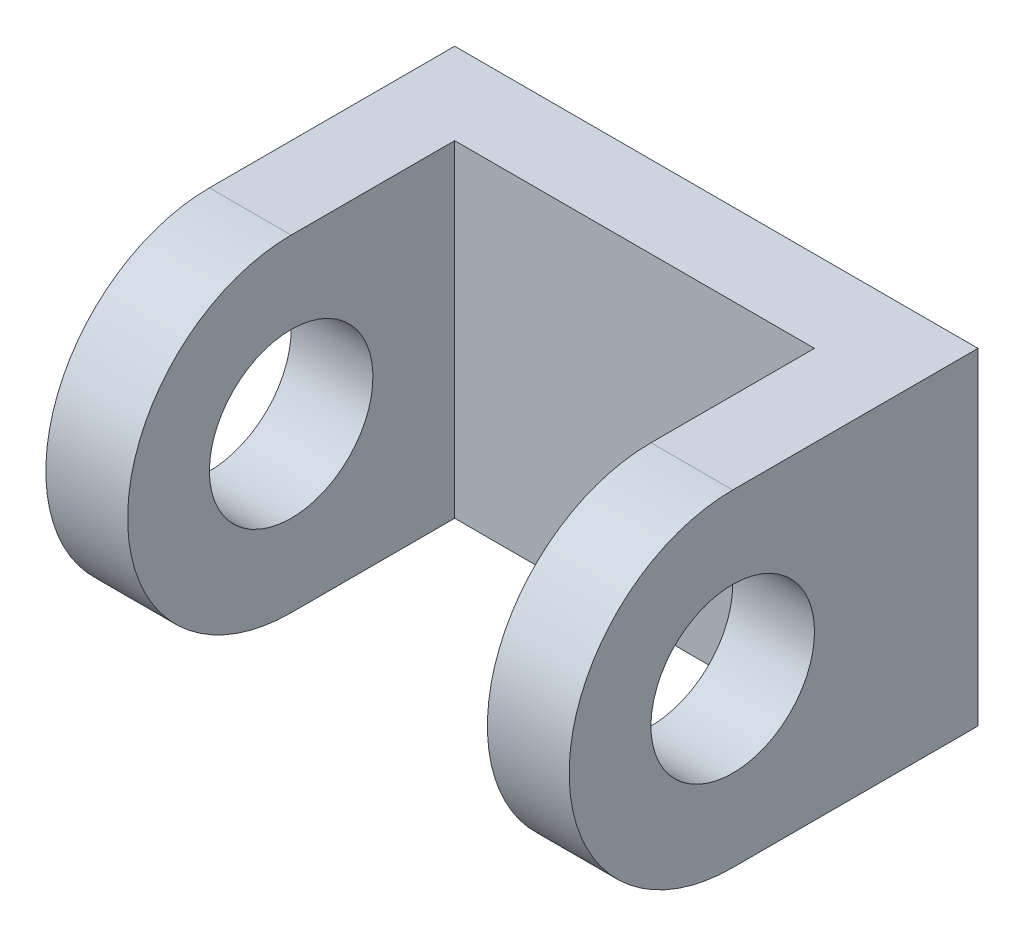
ISO-10303-21;
HEADER;
FILE_DESCRIPTION(('STEP AP214'),'2;1');
FILE_NAME('part.step','',(''),(''),'','','');
FILE_SCHEMA(('AUTOMOTIVE_DESIGN { 1 0 10303 214 1 1 1 1 }'));
ENDSEC;
DATA;
#1=APPLICATION_CONTEXT('core data for automotive mechanical design processes');
#2=APPLICATION_PROTOCOL_DEFINITION('international standard','automotive_design',2000,#1);
#3=PRODUCT_CONTEXT('',#1,'mechanical');
#4=PRODUCT('Part','Part','',(#3));
#5=PRODUCT_RELATED_PRODUCT_CATEGORY('part','',(#4));
#6=PRODUCT_DEFINITION_FORMATION('','',#4);
#7=PRODUCT_DEFINITION_CONTEXT('part definition',#1,'design');
#8=PRODUCT_DEFINITION('design','',#6,#7);
#9=PRODUCT_DEFINITION_SHAPE('','',#8);
#10=(LENGTH_UNIT() NAMED_UNIT(*) SI_UNIT(.MILLI.,.METRE.));
#11=(NAMED_UNIT(*) PLANE_ANGLE_UNIT() SI_UNIT($,.RADIAN.));
#12=(NAMED_UNIT(*) SI_UNIT($,.STERADIAN.) SOLID_ANGLE_UNIT());
#13=UNCERTAINTY_MEASURE_WITH_UNIT(LENGTH_MEASURE(1.E-05),#10,'distance_accuracy_value','');
#14=(GEOMETRIC_REPRESENTATION_CONTEXT(3) GLOBAL_UNCERTAINTY_ASSIGNED_CONTEXT((#13)) GLOBAL_UNIT_ASSIGNED_CONTEXT((#10,
#11,#12)) REPRESENTATION_CONTEXT('',''));
#15=CARTESIAN_POINT('',(0.,0.,0.));
#16=DIRECTION('',(0.,0.,1.));
#17=DIRECTION('',(1.,0.,0.));
#18=AXIS2_PLACEMENT_3D('',#15,#16,#17);
#19=CARTESIAN_POINT('',(20.32,12.7,31.75));
#20=DIRECTION('',(-1.,0.,0.));
#21=DIRECTION('',(0.,-1.,0.));
#22=AXIS2_PLACEMENT_3D('',#19,#20,#21);
#23=PLANE('',#22);
#24=CARTESIAN_POINT('',(20.32,0.,19.05));
#25=DIRECTION('',(1.,0.,0.));
#26=DIRECTION('',(0.,1.,0.));
#27=AXIS2_PLACEMENT_3D('',#24,#25,#26);
#28=CIRCLE('',#27,6.35);
#29=CARTESIAN_POINT('',(20.32,6.35,19.05));
#30=VERTEX_POINT('',#29);
#31=EDGE_CURVE('E137',#30,#30,#28,.T.);
#32=ORIENTED_EDGE('',*,*,#31,.F.);
#33=EDGE_LOOP('',(#32));
#34=FACE_BOUND('',#33,.T.);
#35=CARTESIAN_POINT('',(20.32,0.,19.05));
#36=DIRECTION('',(-1.,0.,0.));
#37=DIRECTION('',(0.,1.,0.));
#38=AXIS2_PLACEMENT_3D('',#35,#36,#37);
#39=CIRCLE('',#38,12.7);
#40=CARTESIAN_POINT('',(20.32,-12.7,19.05));
#41=VERTEX_POINT('',#40);
#42=CARTESIAN_POINT('',(20.32,12.7,19.05));
#43=VERTEX_POINT('',#42);
#44=EDGE_CURVE('E105',#41,#43,#39,.T.);
#45=ORIENTED_EDGE('',*,*,#44,.F.);
#46=DIRECTION('',(0.,0.,-1.));
#47=VECTOR('',#46,1.);
#48=CARTESIAN_POINT('',(20.32,-12.7,31.75));
#49=LINE('',#48,#47);
#50=CARTESIAN_POINT('',(20.32,-12.7,0.));
#51=VERTEX_POINT('',#50);
#52=EDGE_CURVE('E53',#41,#51,#49,.T.);
#53=ORIENTED_EDGE('',*,*,#52,.T.);
#54=DIRECTION('',(0.,1.,0.));
#55=VECTOR('',#54,1.);
#56=CARTESIAN_POINT('',(20.32,12.7,0.));
#57=LINE('',#56,#55);
#58=CARTESIAN_POINT('',(20.32,12.7,0.));
#59=VERTEX_POINT('',#58);
#60=EDGE_CURVE('E162',#51,#59,#57,.T.);
#61=ORIENTED_EDGE('',*,*,#60,.T.);
#62=DIRECTION('',(0.,0.,-1.));
#63=VECTOR('',#62,1.);
#64=CARTESIAN_POINT('',(20.32,12.7,31.75));
#65=LINE('',#64,#63);
#66=EDGE_CURVE('E38',#43,#59,#65,.T.);
#67=ORIENTED_EDGE('',*,*,#66,.F.);
#68=EDGE_LOOP('',(#45,#53,#61,#67));
#69=FACE_BOUND('',#68,.T.);
#70=ADVANCED_FACE('F31',(#34,#69),#23,.F.);
#71=CARTESIAN_POINT('',(-20.32,12.7,31.75));
#72=DIRECTION('',(1.,0.,0.));
#73=DIRECTION('',(0.,1.,0.));
#74=AXIS2_PLACEMENT_3D('',#71,#72,#73);
#75=PLANE('',#74);
#76=CARTESIAN_POINT('',(-20.32,0.,19.05));
#77=DIRECTION('',(1.,0.,0.));
#78=DIRECTION('',(0.,1.,0.));
#79=AXIS2_PLACEMENT_3D('',#76,#77,#78);
#80=CIRCLE('',#79,6.35);
#81=CARTESIAN_POINT('',(-20.32,6.35,19.05));
#82=VERTEX_POINT('',#81);
#83=EDGE_CURVE('E130',#82,#82,#80,.T.);
#84=ORIENTED_EDGE('',*,*,#83,.T.);
#85=EDGE_LOOP('',(#84));
#86=FACE_BOUND('',#85,.T.);
#87=DIRECTION('',(0.,0.,-1.));
#88=VECTOR('',#87,1.);
#89=CARTESIAN_POINT('',(-20.32,-12.7,31.75));
#90=LINE('',#89,#88);
#91=CARTESIAN_POINT('',(-20.32,-12.7,19.05));
#92=VERTEX_POINT('',#91);
#93=CARTESIAN_POINT('',(-20.32,-12.7,0.));
#94=VERTEX_POINT('',#93);
#95=EDGE_CURVE('E109',#92,#94,#90,.T.);
#96=ORIENTED_EDGE('',*,*,#95,.F.);
#97=CARTESIAN_POINT('',(-20.32,0.,19.05));
#98=DIRECTION('',(-1.,0.,0.));
#99=DIRECTION('',(0.,1.,0.));
#100=AXIS2_PLACEMENT_3D('',#97,#98,#99);
#101=CIRCLE('',#100,12.7);
#102=CARTESIAN_POINT('',(-20.32,12.7,19.05));
#103=VERTEX_POINT('',#102);
#104=EDGE_CURVE('E95',#92,#103,#101,.T.);
#105=ORIENTED_EDGE('',*,*,#104,.T.);
#106=DIRECTION('',(0.,0.,-1.));
#107=VECTOR('',#106,1.);
#108=CARTESIAN_POINT('',(-20.32,12.7,31.75));
#109=LINE('',#108,#107);
#110=CARTESIAN_POINT('',(-20.32,12.7,0.));
#111=VERTEX_POINT('',#110);
#112=EDGE_CURVE('E120',#103,#111,#109,.T.);
#113=ORIENTED_EDGE('',*,*,#112,.T.);
#114=DIRECTION('',(0.,-1.,0.));
#115=VECTOR('',#114,1.);
#116=CARTESIAN_POINT('',(-20.32,12.7,0.));
#117=LINE('',#116,#115);
#118=EDGE_CURVE('E118',#111,#94,#117,.T.);
#119=ORIENTED_EDGE('',*,*,#118,.T.);
#120=EDGE_LOOP('',(#96,#105,#113,#119));
#121=FACE_BOUND('',#120,.T.);
#122=ADVANCED_FACE('F116',(#86,#121),#75,.F.);
#123=CARTESIAN_POINT('',(-20.32,-12.7,31.75));
#124=DIRECTION('',(0.,1.,0.));
#125=DIRECTION('',(0.,0.,1.));
#126=AXIS2_PLACEMENT_3D('',#123,#124,#125);
#127=PLANE('',#126);
#128=DIRECTION('',(1.,0.,0.));
#129=VECTOR('',#128,1.);
#130=CARTESIAN_POINT('',(-20.32,-12.7,19.05));
#131=LINE('',#130,#129);
#132=CARTESIAN_POINT('',(-13.97,-12.7,19.05));
#133=VERTEX_POINT('',#132);
#134=EDGE_CURVE('E98',#92,#133,#131,.T.);
#135=ORIENTED_EDGE('',*,*,#134,.F.);
#136=ORIENTED_EDGE('',*,*,#95,.T.);
#137=DIRECTION('',(1.,0.,0.));
#138=VECTOR('',#137,1.);
#139=CARTESIAN_POINT('',(-20.32,-12.7,0.));
#140=LINE('',#139,#138);
#141=EDGE_CURVE('E123',#94,#51,#140,.T.);
#142=ORIENTED_EDGE('',*,*,#141,.T.);
#143=ORIENTED_EDGE('',*,*,#52,.F.);
#144=CARTESIAN_POINT('',(13.97,-12.7,19.05));
#145=VERTEX_POINT('',#144);
#146=EDGE_CURVE('E114',#145,#41,#131,.T.);
#147=ORIENTED_EDGE('',*,*,#146,.F.);
#148=DIRECTION('',(0.,0.,-1.));
#149=VECTOR('',#148,1.);
#150=CARTESIAN_POINT('',(13.97,-12.7,31.75));
#151=LINE('',#150,#149);
#152=CARTESIAN_POINT('',(13.97,-12.7,6.35));
#153=VERTEX_POINT('',#152);
#154=EDGE_CURVE('E147',#145,#153,#151,.T.);
#155=ORIENTED_EDGE('',*,*,#154,.T.);
#156=DIRECTION('',(-1.,0.,0.));
#157=VECTOR('',#156,1.);
#158=CARTESIAN_POINT('',(-13.97,-12.7,6.35));
#159=LINE('',#158,#157);
#160=CARTESIAN_POINT('',(-13.97,-12.7,6.35));
#161=VERTEX_POINT('',#160);
#162=EDGE_CURVE('E149',#153,#161,#159,.T.);
#163=ORIENTED_EDGE('',*,*,#162,.T.);
#164=DIRECTION('',(0.,0.,1.));
#165=VECTOR('',#164,1.);
#166=CARTESIAN_POINT('',(-13.97,-12.7,31.75));
#167=LINE('',#166,#165);
#168=EDGE_CURVE('E113',#161,#133,#167,.T.);
#169=ORIENTED_EDGE('',*,*,#168,.T.);
#170=EDGE_LOOP('',(#135,#136,#142,#143,#147,#155,#163,#169));
#171=FACE_BOUND('',#170,.T.);
#172=ADVANCED_FACE('F108',(#171),#127,.F.);
#173=CARTESIAN_POINT('',(13.97,-12.7,31.75));
#174=DIRECTION('',(1.,0.,0.));
#175=DIRECTION('',(0.,0.,-1.));
#176=AXIS2_PLACEMENT_3D('',#173,#174,#175);
#177=PLANE('',#176);
#178=CARTESIAN_POINT('',(13.97,0.,19.05));
#179=DIRECTION('',(1.,0.,0.));
#180=DIRECTION('',(0.,0.,-1.));
#181=AXIS2_PLACEMENT_3D('',#178,#179,#180);
#182=CIRCLE('',#181,6.35);
#183=CARTESIAN_POINT('',(13.97,0.,12.7));
#184=VERTEX_POINT('',#183);
#185=EDGE_CURVE('E129',#184,#184,#182,.T.);
#186=ORIENTED_EDGE('',*,*,#185,.T.);
#187=EDGE_LOOP('',(#186));
#188=FACE_BOUND('',#187,.T.);
#189=ORIENTED_EDGE('',*,*,#154,.F.);
#190=CARTESIAN_POINT('',(13.97,0.,19.05));
#191=DIRECTION('',(1.,0.,0.));
#192=DIRECTION('',(0.,0.,-1.));
#193=AXIS2_PLACEMENT_3D('',#190,#191,#192);
#194=CIRCLE('',#193,12.7);
#195=CARTESIAN_POINT('',(13.97,12.7,19.05));
#196=VERTEX_POINT('',#195);
#197=EDGE_CURVE('E142',#145,#196,#194,.F.);
#198=ORIENTED_EDGE('',*,*,#197,.T.);
#199=DIRECTION('',(0.,0.,-1.));
#200=VECTOR('',#199,1.);
#201=CARTESIAN_POINT('',(13.97,12.7,31.75));
#202=LINE('',#201,#200);
#203=CARTESIAN_POINT('',(13.97,12.7,6.35));
#204=VERTEX_POINT('',#203);
#205=EDGE_CURVE('E134',#196,#204,#202,.T.);
#206=ORIENTED_EDGE('',*,*,#205,.T.);
#207=DIRECTION('',(0.,1.,0.));
#208=VECTOR('',#207,1.);
#209=CARTESIAN_POINT('',(13.97,-12.7,6.35));
#210=LINE('',#209,#208);
#211=EDGE_CURVE('E153',#153,#204,#210,.T.);
#212=ORIENTED_EDGE('',*,*,#211,.F.);
#213=EDGE_LOOP('',(#189,#198,#206,#212));
#214=FACE_BOUND('',#213,.T.);
#215=ADVANCED_FACE('F185',(#188,#214),#177,.F.);
#216=CARTESIAN_POINT('',(-13.97,-12.7,31.75));
#217=DIRECTION('',(-1.,0.,0.));
#218=DIRECTION('',(0.,0.,1.));
#219=AXIS2_PLACEMENT_3D('',#216,#217,#218);
#220=PLANE('',#219);
#221=CARTESIAN_POINT('',(-13.97,0.,19.05));
#222=DIRECTION('',(-1.,0.,0.));
#223=DIRECTION('',(0.,0.,1.));
#224=AXIS2_PLACEMENT_3D('',#221,#222,#223);
#225=CIRCLE('',#224,6.35);
#226=CARTESIAN_POINT('',(-13.97,0.,25.4));
#227=VERTEX_POINT('',#226);
#228=EDGE_CURVE('E127',#227,#227,#225,.T.);
#229=ORIENTED_EDGE('',*,*,#228,.T.);
#230=EDGE_LOOP('',(#229));
#231=FACE_BOUND('',#230,.T.);
#232=CARTESIAN_POINT('',(-13.97,0.,19.05));
#233=DIRECTION('',(-1.,0.,0.));
#234=DIRECTION('',(0.,0.,1.));
#235=AXIS2_PLACEMENT_3D('',#232,#233,#234);
#236=CIRCLE('',#235,12.7);
#237=CARTESIAN_POINT('',(-13.97,12.7,19.05));
#238=VERTEX_POINT('',#237);
#239=EDGE_CURVE('E11',#238,#133,#236,.F.);
#240=ORIENTED_EDGE('',*,*,#239,.T.);
#241=ORIENTED_EDGE('',*,*,#168,.F.);
#242=DIRECTION('',(0.,1.,0.));
#243=VECTOR('',#242,1.);
#244=CARTESIAN_POINT('',(-13.97,-12.7,6.35));
#245=LINE('',#244,#243);
#246=CARTESIAN_POINT('',(-13.97,12.7,6.35));
#247=VERTEX_POINT('',#246);
#248=EDGE_CURVE('E160',#161,#247,#245,.T.);
#249=ORIENTED_EDGE('',*,*,#248,.T.);
#250=DIRECTION('',(0.,0.,1.));
#251=VECTOR('',#250,1.);
#252=CARTESIAN_POINT('',(-13.97,12.7,31.75));
#253=LINE('',#252,#251);
#254=EDGE_CURVE('E150',#247,#238,#253,.T.);
#255=ORIENTED_EDGE('',*,*,#254,.T.);
#256=EDGE_LOOP('',(#240,#241,#249,#255));
#257=FACE_BOUND('',#256,.T.);
#258=ADVANCED_FACE('F191',(#231,#257),#220,.F.);
#259=CARTESIAN_POINT('',(-20.32,12.7,31.75));
#260=DIRECTION('',(0.,-1.,0.));
#261=DIRECTION('',(0.,0.,-1.));
#262=AXIS2_PLACEMENT_3D('',#259,#260,#261);
#263=PLANE('',#262);
#264=DIRECTION('',(1.,0.,0.));
#265=VECTOR('',#264,1.);
#266=CARTESIAN_POINT('',(-20.32,12.7,19.05));
#267=LINE('',#266,#265);
#268=EDGE_CURVE('E45',#196,#43,#267,.T.);
#269=ORIENTED_EDGE('',*,*,#268,.T.);
#270=ORIENTED_EDGE('',*,*,#66,.T.);
#271=DIRECTION('',(-1.,0.,0.));
#272=VECTOR('',#271,1.);
#273=CARTESIAN_POINT('',(-20.32,12.7,0.));
#274=LINE('',#273,#272);
#275=EDGE_CURVE('E166',#59,#111,#274,.T.);
#276=ORIENTED_EDGE('',*,*,#275,.T.);
#277=ORIENTED_EDGE('',*,*,#112,.F.);
#278=EDGE_CURVE('E101',#103,#238,#267,.T.);
#279=ORIENTED_EDGE('',*,*,#278,.T.);
#280=ORIENTED_EDGE('',*,*,#254,.F.);
#281=DIRECTION('',(-1.,0.,0.));
#282=VECTOR('',#281,1.);
#283=CARTESIAN_POINT('',(-13.97,12.7,6.35));
#284=LINE('',#283,#282);
#285=EDGE_CURVE('E155',#204,#247,#284,.T.);
#286=ORIENTED_EDGE('',*,*,#285,.F.);
#287=ORIENTED_EDGE('',*,*,#205,.F.);
#288=EDGE_LOOP('',(#269,#270,#276,#277,#279,#280,#286,#287));
#289=FACE_BOUND('',#288,.T.);
#290=ADVANCED_FACE('F177',(#289),#263,.F.);
#291=CARTESIAN_POINT('',(20.32,-12.7,0.));
#292=DIRECTION('',(0.,0.,1.));
#293=DIRECTION('',(1.,0.,0.));
#294=AXIS2_PLACEMENT_3D('',#291,#292,#293);
#295=PLANE('',#294);
#296=ORIENTED_EDGE('',*,*,#60,.F.);
#297=ORIENTED_EDGE('',*,*,#141,.F.);
#298=ORIENTED_EDGE('',*,*,#118,.F.);
#299=ORIENTED_EDGE('',*,*,#275,.F.);
#300=EDGE_LOOP('',(#296,#297,#298,#299));
#301=FACE_BOUND('',#300,.T.);
#302=ADVANCED_FACE('F173',(#301),#295,.F.);
#303=CARTESIAN_POINT('',(-13.97,-12.7,6.35));
#304=DIRECTION('',(0.,0.,-1.));
#305=DIRECTION('',(-1.,0.,0.));
#306=AXIS2_PLACEMENT_3D('',#303,#304,#305);
#307=PLANE('',#306);
#308=ORIENTED_EDGE('',*,*,#285,.T.);
#309=ORIENTED_EDGE('',*,*,#248,.F.);
#310=ORIENTED_EDGE('',*,*,#162,.F.);
#311=ORIENTED_EDGE('',*,*,#211,.T.);
#312=EDGE_LOOP('',(#308,#309,#310,#311));
#313=FACE_BOUND('',#312,.T.);
#314=ADVANCED_FACE('F188',(#313),#307,.F.);
#315=CARTESIAN_POINT('',(-20.32,0.,19.05));
#316=DIRECTION('',(1.,0.,0.));
#317=DIRECTION('',(0.,1.,0.));
#318=AXIS2_PLACEMENT_3D('',#315,#316,#317);
#319=CYLINDRICAL_SURFACE('',#318,6.35);
#320=ORIENTED_EDGE('',*,*,#83,.F.);
#321=EDGE_LOOP('',(#320));
#322=FACE_BOUND('',#321,.T.);
#323=ORIENTED_EDGE('',*,*,#228,.F.);
#324=EDGE_LOOP('',(#323));
#325=FACE_BOUND('',#324,.T.);
#326=ADVANCED_FACE('F213',(#322,#325),#319,.F.);
#327=ORIENTED_EDGE('',*,*,#31,.T.);
#328=EDGE_LOOP('',(#327));
#329=FACE_BOUND('',#328,.T.);
#330=ORIENTED_EDGE('',*,*,#185,.F.);
#331=EDGE_LOOP('',(#330));
#332=FACE_BOUND('',#331,.T.);
#333=ADVANCED_FACE('F210',(#329,#332),#319,.F.);
#334=CARTESIAN_POINT('',(-20.32,0.,19.05));
#335=DIRECTION('',(1.,0.,0.));
#336=DIRECTION('',(0.,1.,0.));
#337=AXIS2_PLACEMENT_3D('',#334,#335,#336);
#338=CYLINDRICAL_SURFACE('',#337,12.7);
#339=ORIENTED_EDGE('',*,*,#278,.F.);
#340=ORIENTED_EDGE('',*,*,#104,.F.);
#341=ORIENTED_EDGE('',*,*,#134,.T.);
#342=ORIENTED_EDGE('',*,*,#239,.F.);
#343=EDGE_LOOP('',(#339,#340,#341,#342));
#344=FACE_BOUND('',#343,.T.);
#345=ADVANCED_FACE('F97',(#344),#338,.T.);
#346=ORIENTED_EDGE('',*,*,#197,.F.);
#347=ORIENTED_EDGE('',*,*,#146,.T.);
#348=ORIENTED_EDGE('',*,*,#44,.T.);
#349=ORIENTED_EDGE('',*,*,#268,.F.);
#350=EDGE_LOOP('',(#346,#347,#348,#349));
#351=FACE_BOUND('',#350,.T.);
#352=ADVANCED_FACE('F181',(#351),#338,.T.);
#353=CLOSED_SHELL('',(#70,#122,#172,#215,#258,#290,#302,#314,#326,#333,#345,#352));
#354=MANIFOLD_SOLID_BREP('B2',#353);
#355=ADVANCED_BREP_SHAPE_REPRESENTATION('',(#18,#354),#14);
#356=SHAPE_DEFINITION_REPRESENTATION(#9,#355);
ENDSEC;
END-ISO-10303-21;
